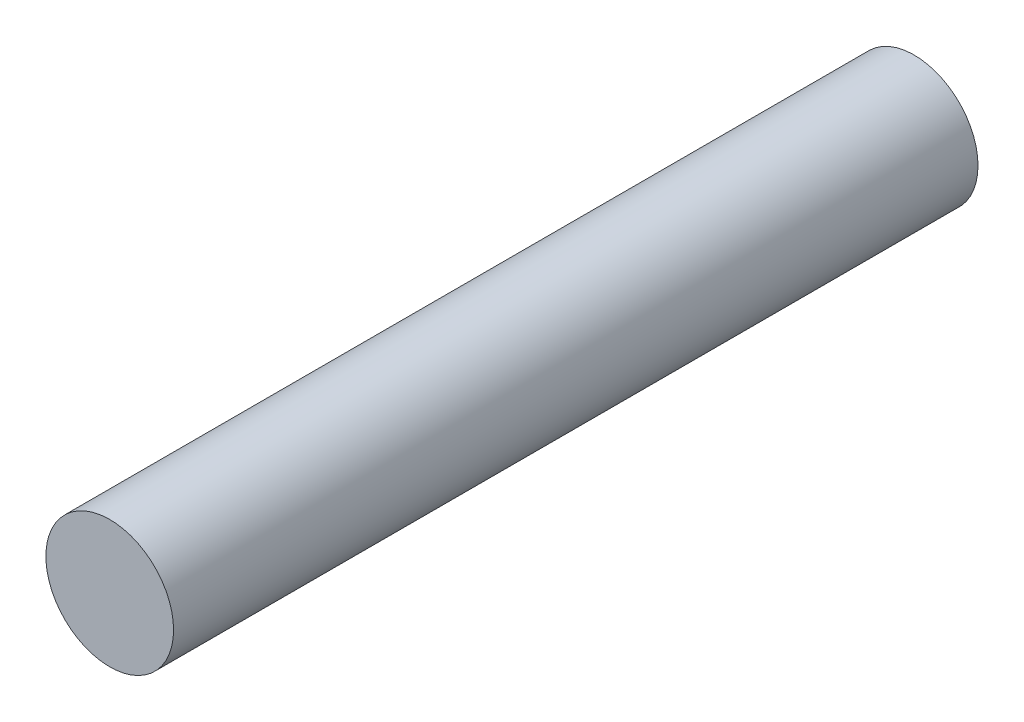
ISO-10303-21;
HEADER;
FILE_DESCRIPTION(('STEP AP214'),'2;1');
FILE_NAME('part.step','',(''),(''),'','','');
FILE_SCHEMA(('AUTOMOTIVE_DESIGN { 1 0 10303 214 1 1 1 1 }'));
ENDSEC;
DATA;
#1=APPLICATION_CONTEXT('core data for automotive mechanical design processes');
#2=APPLICATION_PROTOCOL_DEFINITION('international standard','automotive_design',2000,#1);
#3=PRODUCT_CONTEXT('',#1,'mechanical');
#4=PRODUCT('Part','Part','',(#3));
#5=PRODUCT_RELATED_PRODUCT_CATEGORY('part','',(#4));
#6=PRODUCT_DEFINITION_FORMATION('','',#4);
#7=PRODUCT_DEFINITION_CONTEXT('part definition',#1,'design');
#8=PRODUCT_DEFINITION('design','',#6,#7);
#9=PRODUCT_DEFINITION_SHAPE('','',#8);
#10=(LENGTH_UNIT() NAMED_UNIT(*) SI_UNIT(.MILLI.,.METRE.));
#11=(NAMED_UNIT(*) PLANE_ANGLE_UNIT() SI_UNIT($,.RADIAN.));
#12=(NAMED_UNIT(*) SI_UNIT($,.STERADIAN.) SOLID_ANGLE_UNIT());
#13=UNCERTAINTY_MEASURE_WITH_UNIT(LENGTH_MEASURE(1.E-05),#10,'distance_accuracy_value','');
#14=(GEOMETRIC_REPRESENTATION_CONTEXT(3) GLOBAL_UNCERTAINTY_ASSIGNED_CONTEXT((#13)) GLOBAL_UNIT_ASSIGNED_CONTEXT((#10,
#11,#12)) REPRESENTATION_CONTEXT('',''));
#15=CARTESIAN_POINT('',(0.,0.,0.));
#16=DIRECTION('',(0.,0.,1.));
#17=DIRECTION('',(1.,0.,0.));
#18=AXIS2_PLACEMENT_3D('',#15,#16,#17);
#19=CARTESIAN_POINT('',(0.,0.,63.));
#20=DIRECTION('',(0.,0.,-1.));
#21=DIRECTION('',(-1.,0.,0.));
#22=AXIS2_PLACEMENT_3D('',#19,#20,#21);
#23=CYLINDRICAL_SURFACE('',#22,5.);
#24=CARTESIAN_POINT('',(0.,0.,63.));
#25=DIRECTION('',(0.,0.,1.));
#26=DIRECTION('',(1.,0.,0.));
#27=AXIS2_PLACEMENT_3D('',#24,#25,#26);
#28=CIRCLE('',#27,5.);
#29=CARTESIAN_POINT('',(5.,0.,63.));
#30=VERTEX_POINT('',#29);
#31=EDGE_CURVE('E10',#30,#30,#28,.T.);
#32=ORIENTED_EDGE('',*,*,#31,.F.);
#33=EDGE_LOOP('',(#32));
#34=FACE_BOUND('',#33,.T.);
#35=CARTESIAN_POINT('',(0.,0.,0.));
#36=DIRECTION('',(0.,0.,1.));
#37=DIRECTION('',(1.,0.,0.));
#38=AXIS2_PLACEMENT_3D('',#35,#36,#37);
#39=CIRCLE('',#38,5.);
#40=CARTESIAN_POINT('',(5.,0.,0.));
#41=VERTEX_POINT('',#40);
#42=EDGE_CURVE('E40',#41,#41,#39,.T.);
#43=ORIENTED_EDGE('',*,*,#42,.T.);
#44=EDGE_LOOP('',(#43));
#45=FACE_BOUND('',#44,.T.);
#46=ADVANCED_FACE('F37',(#34,#45),#23,.T.);
#47=CARTESIAN_POINT('',(0.,0.,63.));
#48=DIRECTION('',(0.,0.,1.));
#49=DIRECTION('',(1.,0.,0.));
#50=AXIS2_PLACEMENT_3D('',#47,#48,#49);
#51=PLANE('',#50);
#52=ORIENTED_EDGE('',*,*,#31,.T.);
#53=EDGE_LOOP('',(#52));
#54=FACE_BOUND('',#53,.T.);
#55=ADVANCED_FACE('F54',(#54),#51,.T.);
#56=CARTESIAN_POINT('',(0.,0.,0.));
#57=DIRECTION('',(0.,0.,1.));
#58=DIRECTION('',(1.,0.,0.));
#59=AXIS2_PLACEMENT_3D('',#56,#57,#58);
#60=PLANE('',#59);
#61=ORIENTED_EDGE('',*,*,#42,.F.);
#62=EDGE_LOOP('',(#61));
#63=FACE_BOUND('',#62,.T.);
#64=ADVANCED_FACE('F52',(#63),#60,.F.);
#65=CLOSED_SHELL('',(#46,#55,#64));
#66=MANIFOLD_SOLID_BREP('B2',#65);
#67=ADVANCED_BREP_SHAPE_REPRESENTATION('',(#18,#66),#14);
#68=SHAPE_DEFINITION_REPRESENTATION(#9,#67);
ENDSEC;
END-ISO-10303-21;
